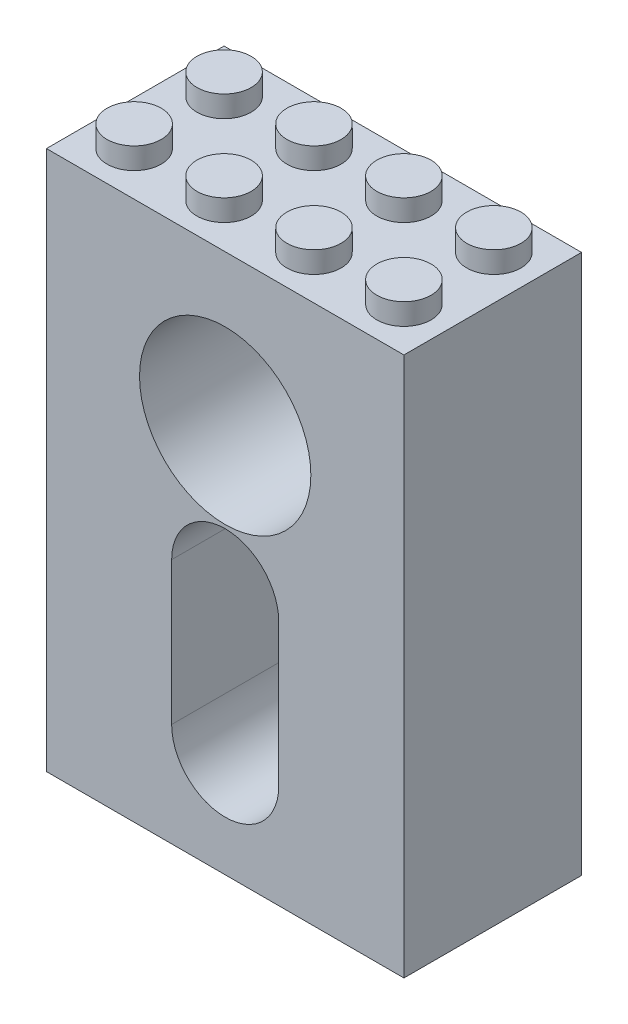
ISO-10303-21;
HEADER;
FILE_DESCRIPTION(('STEP AP214'),'2;1');
FILE_NAME('part.step','',(''),(''),'','','');
FILE_SCHEMA(('AUTOMOTIVE_DESIGN { 1 0 10303 214 1 1 1 1 }'));
ENDSEC;
DATA;
#1=APPLICATION_CONTEXT('core data for automotive mechanical design processes');
#2=APPLICATION_PROTOCOL_DEFINITION('international standard','automotive_design',2000,#1);
#3=PRODUCT_CONTEXT('',#1,'mechanical');
#4=PRODUCT('Part','Part','',(#3));
#5=PRODUCT_RELATED_PRODUCT_CATEGORY('part','',(#4));
#6=PRODUCT_DEFINITION_FORMATION('','',#4);
#7=PRODUCT_DEFINITION_CONTEXT('part definition',#1,'design');
#8=PRODUCT_DEFINITION('design','',#6,#7);
#9=PRODUCT_DEFINITION_SHAPE('','',#8);
#10=(LENGTH_UNIT() NAMED_UNIT(*) SI_UNIT(.MILLI.,.METRE.));
#11=(NAMED_UNIT(*) PLANE_ANGLE_UNIT() SI_UNIT($,.RADIAN.));
#12=(NAMED_UNIT(*) SI_UNIT($,.STERADIAN.) SOLID_ANGLE_UNIT());
#13=UNCERTAINTY_MEASURE_WITH_UNIT(LENGTH_MEASURE(1.E-05),#10,'distance_accuracy_value','');
#14=(GEOMETRIC_REPRESENTATION_CONTEXT(3) GLOBAL_UNCERTAINTY_ASSIGNED_CONTEXT((#13)) GLOBAL_UNIT_ASSIGNED_CONTEXT((#10,
#11,#12)) REPRESENTATION_CONTEXT('',''));
#15=CARTESIAN_POINT('',(0.,0.,0.));
#16=DIRECTION('',(0.,0.,1.));
#17=DIRECTION('',(1.,0.,0.));
#18=AXIS2_PLACEMENT_3D('',#15,#16,#17);
#19=CARTESIAN_POINT('',(-15.9,24.,15.8));
#20=DIRECTION('',(0.,-1.,0.));
#21=DIRECTION('',(0.,0.,-1.));
#22=AXIS2_PLACEMENT_3D('',#19,#20,#21);
#23=PLANE('',#22);
#24=CARTESIAN_POINT('',(12.,24.,3.9));
#25=DIRECTION('',(0.,-1.,0.));
#26=DIRECTION('',(0.,0.,-1.));
#27=AXIS2_PLACEMENT_3D('',#24,#25,#26);
#28=CIRCLE('',#27,2.41);
#29=CARTESIAN_POINT('',(12.,24.,1.49));
#30=VERTEX_POINT('',#29);
#31=EDGE_CURVE('E40',#30,#30,#28,.F.);
#32=ORIENTED_EDGE('',*,*,#31,.F.);
#33=EDGE_LOOP('',(#32));
#34=FACE_BOUND('',#33,.T.);
#35=CARTESIAN_POINT('',(4.,24.,3.9));
#36=DIRECTION('',(0.,-1.,0.));
#37=DIRECTION('',(0.,0.,-1.));
#38=AXIS2_PLACEMENT_3D('',#35,#36,#37);
#39=CIRCLE('',#38,2.41);
#40=CARTESIAN_POINT('',(4.,24.,1.49));
#41=VERTEX_POINT('',#40);
#42=EDGE_CURVE('E339',#41,#41,#39,.F.);
#43=ORIENTED_EDGE('',*,*,#42,.F.);
#44=EDGE_LOOP('',(#43));
#45=FACE_BOUND('',#44,.T.);
#46=CARTESIAN_POINT('',(-4.,24.,3.9));
#47=DIRECTION('',(0.,-1.,0.));
#48=DIRECTION('',(0.,0.,-1.));
#49=AXIS2_PLACEMENT_3D('',#46,#47,#48);
#50=CIRCLE('',#49,2.41);
#51=CARTESIAN_POINT('',(-4.,24.,1.49));
#52=VERTEX_POINT('',#51);
#53=EDGE_CURVE('E333',#52,#52,#50,.F.);
#54=ORIENTED_EDGE('',*,*,#53,.F.);
#55=EDGE_LOOP('',(#54));
#56=FACE_BOUND('',#55,.T.);
#57=CARTESIAN_POINT('',(-12.,24.,3.9));
#58=DIRECTION('',(0.,-1.,0.));
#59=DIRECTION('',(0.,0.,-1.));
#60=AXIS2_PLACEMENT_3D('',#57,#58,#59);
#61=CIRCLE('',#60,2.41);
#62=CARTESIAN_POINT('',(-12.,24.,1.49));
#63=VERTEX_POINT('',#62);
#64=EDGE_CURVE('E319',#63,#63,#61,.F.);
#65=ORIENTED_EDGE('',*,*,#64,.F.);
#66=EDGE_LOOP('',(#65));
#67=FACE_BOUND('',#66,.T.);
#68=DIRECTION('',(-1.,0.,0.));
#69=VECTOR('',#68,1.);
#70=CARTESIAN_POINT('',(-15.9,24.,0.));
#71=LINE('',#70,#69);
#72=CARTESIAN_POINT('',(15.9,24.,0.));
#73=VERTEX_POINT('',#72);
#74=CARTESIAN_POINT('',(-15.9,24.,0.));
#75=VERTEX_POINT('',#74);
#76=EDGE_CURVE('E303',#73,#75,#71,.T.);
#77=ORIENTED_EDGE('',*,*,#76,.T.);
#78=DIRECTION('',(0.,0.,-1.));
#79=VECTOR('',#78,1.);
#80=CARTESIAN_POINT('',(-15.9,24.,15.8));
#81=LINE('',#80,#79);
#82=CARTESIAN_POINT('',(-15.9,24.,15.8));
#83=VERTEX_POINT('',#82);
#84=EDGE_CURVE('E313',#83,#75,#81,.T.);
#85=ORIENTED_EDGE('',*,*,#84,.F.);
#86=DIRECTION('',(-1.,0.,0.));
#87=VECTOR('',#86,1.);
#88=CARTESIAN_POINT('',(-15.9,24.,15.8));
#89=LINE('',#88,#87);
#90=CARTESIAN_POINT('',(15.9,24.,15.8));
#91=VERTEX_POINT('',#90);
#92=EDGE_CURVE('E293',#91,#83,#89,.T.);
#93=ORIENTED_EDGE('',*,*,#92,.F.);
#94=DIRECTION('',(0.,0.,-1.));
#95=VECTOR('',#94,1.);
#96=CARTESIAN_POINT('',(15.9,24.,15.8));
#97=LINE('',#96,#95);
#98=EDGE_CURVE('E316',#91,#73,#97,.T.);
#99=ORIENTED_EDGE('',*,*,#98,.T.);
#100=EDGE_LOOP('',(#77,#85,#93,#99));
#101=FACE_BOUND('',#100,.T.);
#102=CARTESIAN_POINT('',(-12.,24.,11.9));
#103=DIRECTION('',(0.,-1.,0.));
#104=DIRECTION('',(0.,0.,-1.));
#105=AXIS2_PLACEMENT_3D('',#102,#103,#104);
#106=CIRCLE('',#105,2.41);
#107=CARTESIAN_POINT('',(-12.,24.,9.49));
#108=VERTEX_POINT('',#107);
#109=EDGE_CURVE('E330',#108,#108,#106,.F.);
#110=ORIENTED_EDGE('',*,*,#109,.F.);
#111=EDGE_LOOP('',(#110));
#112=FACE_BOUND('',#111,.T.);
#113=CARTESIAN_POINT('',(-4.,24.,11.9));
#114=DIRECTION('',(0.,-1.,0.));
#115=DIRECTION('',(0.,0.,-1.));
#116=AXIS2_PLACEMENT_3D('',#113,#114,#115);
#117=CIRCLE('',#116,2.41);
#118=CARTESIAN_POINT('',(-4.,24.,9.49));
#119=VERTEX_POINT('',#118);
#120=EDGE_CURVE('E336',#119,#119,#117,.F.);
#121=ORIENTED_EDGE('',*,*,#120,.F.);
#122=EDGE_LOOP('',(#121));
#123=FACE_BOUND('',#122,.T.);
#124=CARTESIAN_POINT('',(4.,24.,11.9));
#125=DIRECTION('',(0.,-1.,0.));
#126=DIRECTION('',(0.,0.,-1.));
#127=AXIS2_PLACEMENT_3D('',#124,#125,#126);
#128=CIRCLE('',#127,2.41);
#129=CARTESIAN_POINT('',(4.,24.,9.49));
#130=VERTEX_POINT('',#129);
#131=EDGE_CURVE('E342',#130,#130,#128,.F.);
#132=ORIENTED_EDGE('',*,*,#131,.F.);
#133=EDGE_LOOP('',(#132));
#134=FACE_BOUND('',#133,.T.);
#135=CARTESIAN_POINT('',(12.,24.,11.9));
#136=DIRECTION('',(0.,-1.,0.));
#137=DIRECTION('',(0.,0.,-1.));
#138=AXIS2_PLACEMENT_3D('',#135,#136,#137);
#139=CIRCLE('',#138,2.41);
#140=CARTESIAN_POINT('',(12.,24.,9.49));
#141=VERTEX_POINT('',#140);
#142=EDGE_CURVE('E11',#141,#141,#139,.F.);
#143=ORIENTED_EDGE('',*,*,#142,.F.);
#144=EDGE_LOOP('',(#143));
#145=FACE_BOUND('',#144,.T.);
#146=ADVANCED_FACE('F32',(#34,#45,#56,#67,#101,#112,#123,#134,#145),#23,.F.);
#147=CARTESIAN_POINT('',(0.,-2.1,12.7));
#148=DIRECTION('',(0.,0.,-1.));
#149=DIRECTION('',(-1.,0.,0.));
#150=AXIS2_PLACEMENT_3D('',#147,#148,#149);
#151=CYLINDRICAL_SURFACE('',#150,1.8415);
#152=CARTESIAN_POINT('',(0.,-2.1,3.1));
#153=DIRECTION('',(0.,0.,1.));
#154=DIRECTION('',(1.,0.,0.));
#155=AXIS2_PLACEMENT_3D('',#152,#153,#154);
#156=CIRCLE('',#155,1.8415);
#157=CARTESIAN_POINT('',(1.8415,-2.1,3.1));
#158=VERTEX_POINT('',#157);
#159=EDGE_CURVE('E250',#158,#158,#156,.T.);
#160=ORIENTED_EDGE('',*,*,#159,.T.);
#161=EDGE_LOOP('',(#160));
#162=FACE_BOUND('',#161,.T.);
#163=CARTESIAN_POINT('',(0.,-2.1,1.905));
#164=DIRECTION('',(0.,0.,-1.));
#165=DIRECTION('',(-1.,0.,0.));
#166=AXIS2_PLACEMENT_3D('',#163,#164,#165);
#167=CIRCLE('',#166,1.8415);
#168=CARTESIAN_POINT('',(-1.8415,-2.1,1.905));
#169=VERTEX_POINT('',#168);
#170=EDGE_CURVE('E242',#169,#169,#167,.F.);
#171=ORIENTED_EDGE('',*,*,#170,.F.);
#172=EDGE_LOOP('',(#171));
#173=FACE_BOUND('',#172,.T.);
#174=ADVANCED_FACE('F351',(#162,#173),#151,.F.);
#175=CARTESIAN_POINT('',(0.,-14.8,12.7));
#176=DIRECTION('',(0.,0.,-1.));
#177=DIRECTION('',(-1.,0.,0.));
#178=AXIS2_PLACEMENT_3D('',#175,#176,#177);
#179=CYLINDRICAL_SURFACE('',#178,1.8415);
#180=CARTESIAN_POINT('',(0.,-14.8,3.1));
#181=DIRECTION('',(0.,0.,1.));
#182=DIRECTION('',(1.,0.,0.));
#183=AXIS2_PLACEMENT_3D('',#180,#181,#182);
#184=CIRCLE('',#183,1.8415);
#185=CARTESIAN_POINT('',(1.8415,-14.8,3.1));
#186=VERTEX_POINT('',#185);
#187=EDGE_CURVE('E245',#186,#186,#184,.T.);
#188=ORIENTED_EDGE('',*,*,#187,.T.);
#189=EDGE_LOOP('',(#188));
#190=FACE_BOUND('',#189,.T.);
#191=CARTESIAN_POINT('',(0.,-14.8,1.905));
#192=DIRECTION('',(0.,0.,-1.));
#193=DIRECTION('',(-1.,0.,0.));
#194=AXIS2_PLACEMENT_3D('',#191,#192,#193);
#195=CIRCLE('',#194,1.8415);
#196=CARTESIAN_POINT('',(-1.8415,-14.8,1.905));
#197=VERTEX_POINT('',#196);
#198=EDGE_CURVE('E236',#197,#197,#195,.F.);
#199=ORIENTED_EDGE('',*,*,#198,.F.);
#200=EDGE_LOOP('',(#199));
#201=FACE_BOUND('',#200,.T.);
#202=ADVANCED_FACE('F456',(#190,#201),#179,.F.);
#203=CARTESIAN_POINT('',(15.9,24.,15.8));
#204=DIRECTION('',(-1.,0.,0.));
#205=DIRECTION('',(0.,-1.,0.));
#206=AXIS2_PLACEMENT_3D('',#203,#204,#205);
#207=PLANE('',#206);
#208=DIRECTION('',(0.,1.,0.));
#209=VECTOR('',#208,1.);
#210=CARTESIAN_POINT('',(15.9,24.,0.));
#211=LINE('',#210,#209);
#212=CARTESIAN_POINT('',(15.9,-24.,0.));
#213=VERTEX_POINT('',#212);
#214=EDGE_CURVE('E287',#213,#73,#211,.T.);
#215=ORIENTED_EDGE('',*,*,#214,.T.);
#216=ORIENTED_EDGE('',*,*,#98,.F.);
#217=DIRECTION('',(0.,1.,0.));
#218=VECTOR('',#217,1.);
#219=CARTESIAN_POINT('',(15.9,24.,15.8));
#220=LINE('',#219,#218);
#221=CARTESIAN_POINT('',(15.9,-24.,15.8));
#222=VERTEX_POINT('',#221);
#223=EDGE_CURVE('E290',#222,#91,#220,.T.);
#224=ORIENTED_EDGE('',*,*,#223,.F.);
#225=DIRECTION('',(0.,0.,-1.));
#226=VECTOR('',#225,1.);
#227=CARTESIAN_POINT('',(15.9,-24.,15.8));
#228=LINE('',#227,#226);
#229=EDGE_CURVE('E300',#222,#213,#228,.T.);
#230=ORIENTED_EDGE('',*,*,#229,.T.);
#231=EDGE_LOOP('',(#215,#216,#224,#230));
#232=FACE_BOUND('',#231,.T.);
#233=ADVANCED_FACE('F34',(#232),#207,.F.);
#234=CARTESIAN_POINT('',(-15.9,24.,15.8));
#235=DIRECTION('',(1.,0.,0.));
#236=DIRECTION('',(0.,1.,0.));
#237=AXIS2_PLACEMENT_3D('',#234,#235,#236);
#238=PLANE('',#237);
#239=DIRECTION('',(0.,-1.,0.));
#240=VECTOR('',#239,1.);
#241=CARTESIAN_POINT('',(-15.9,24.,0.));
#242=LINE('',#241,#240);
#243=CARTESIAN_POINT('',(-15.9,-24.,0.));
#244=VERTEX_POINT('',#243);
#245=EDGE_CURVE('E305',#75,#244,#242,.T.);
#246=ORIENTED_EDGE('',*,*,#245,.T.);
#247=DIRECTION('',(0.,0.,-1.));
#248=VECTOR('',#247,1.);
#249=CARTESIAN_POINT('',(-15.9,-24.,15.8));
#250=LINE('',#249,#248);
#251=CARTESIAN_POINT('',(-15.9,-24.,15.8));
#252=VERTEX_POINT('',#251);
#253=EDGE_CURVE('E310',#252,#244,#250,.T.);
#254=ORIENTED_EDGE('',*,*,#253,.F.);
#255=DIRECTION('',(0.,-1.,0.));
#256=VECTOR('',#255,1.);
#257=CARTESIAN_POINT('',(-15.9,24.,15.8));
#258=LINE('',#257,#256);
#259=EDGE_CURVE('E296',#83,#252,#258,.T.);
#260=ORIENTED_EDGE('',*,*,#259,.F.);
#261=ORIENTED_EDGE('',*,*,#84,.T.);
#262=EDGE_LOOP('',(#246,#254,#260,#261));
#263=FACE_BOUND('',#262,.T.);
#264=ADVANCED_FACE('F505',(#263),#238,.F.);
#265=CARTESIAN_POINT('',(-15.9,-24.,15.8));
#266=DIRECTION('',(0.,1.,0.));
#267=DIRECTION('',(0.,0.,1.));
#268=AXIS2_PLACEMENT_3D('',#265,#266,#267);
#269=PLANE('',#268);
#270=DIRECTION('',(1.,0.,0.));
#271=VECTOR('',#270,1.);
#272=CARTESIAN_POINT('',(-14.68,-24.,1.22));
#273=LINE('',#272,#271);
#274=CARTESIAN_POINT('',(-14.68,-24.,1.22));
#275=VERTEX_POINT('',#274);
#276=CARTESIAN_POINT('',(14.68,-24.,1.22));
#277=VERTEX_POINT('',#276);
#278=EDGE_CURVE('E177',#275,#277,#273,.T.);
#279=ORIENTED_EDGE('',*,*,#278,.F.);
#280=DIRECTION('',(0.,0.,-1.));
#281=VECTOR('',#280,1.);
#282=CARTESIAN_POINT('',(-14.68,-24.,14.58));
#283=LINE('',#282,#281);
#284=CARTESIAN_POINT('',(-14.68,-24.,14.58));
#285=VERTEX_POINT('',#284);
#286=EDGE_CURVE('E47',#285,#275,#283,.T.);
#287=ORIENTED_EDGE('',*,*,#286,.F.);
#288=DIRECTION('',(-1.,0.,0.));
#289=VECTOR('',#288,1.);
#290=CARTESIAN_POINT('',(-14.68,-24.,14.58));
#291=LINE('',#290,#289);
#292=CARTESIAN_POINT('',(14.68,-24.,14.58));
#293=VERTEX_POINT('',#292);
#294=EDGE_CURVE('E165',#293,#285,#291,.T.);
#295=ORIENTED_EDGE('',*,*,#294,.F.);
#296=DIRECTION('',(0.,0.,1.));
#297=VECTOR('',#296,1.);
#298=CARTESIAN_POINT('',(14.68,-24.,14.58));
#299=LINE('',#298,#297);
#300=EDGE_CURVE('E168',#277,#293,#299,.T.);
#301=ORIENTED_EDGE('',*,*,#300,.F.);
#302=EDGE_LOOP('',(#279,#287,#295,#301));
#303=FACE_BOUND('',#302,.T.);
#304=DIRECTION('',(1.,0.,0.));
#305=VECTOR('',#304,1.);
#306=CARTESIAN_POINT('',(-15.9,-24.,0.));
#307=LINE('',#306,#305);
#308=EDGE_CURVE('E294',#244,#213,#307,.T.);
#309=ORIENTED_EDGE('',*,*,#308,.T.);
#310=ORIENTED_EDGE('',*,*,#229,.F.);
#311=DIRECTION('',(1.,0.,0.));
#312=VECTOR('',#311,1.);
#313=CARTESIAN_POINT('',(-15.9,-24.,15.8));
#314=LINE('',#313,#312);
#315=EDGE_CURVE('E298',#252,#222,#314,.T.);
#316=ORIENTED_EDGE('',*,*,#315,.F.);
#317=ORIENTED_EDGE('',*,*,#253,.T.);
#318=EDGE_LOOP('',(#309,#310,#316,#317));
#319=FACE_BOUND('',#318,.T.);
#320=ADVANCED_FACE('F498',(#303,#319),#269,.F.);
#321=CARTESIAN_POINT('',(15.9,-24.,15.8));
#322=DIRECTION('',(0.,0.,1.));
#323=DIRECTION('',(1.,0.,0.));
#324=AXIS2_PLACEMENT_3D('',#321,#322,#323);
#325=PLANE('',#324);
#326=CARTESIAN_POINT('',(0.,-2.1,15.8));
#327=DIRECTION('',(0.,0.,1.));
#328=DIRECTION('',(1.,0.,0.));
#329=AXIS2_PLACEMENT_3D('',#326,#327,#328);
#330=CIRCLE('',#329,4.7625);
#331=CARTESIAN_POINT('',(4.7625,-2.1,15.8));
#332=VERTEX_POINT('',#331);
#333=CARTESIAN_POINT('',(-4.7625,-2.1,15.8));
#334=VERTEX_POINT('',#333);
#335=EDGE_CURVE('E265',#332,#334,#330,.T.);
#336=ORIENTED_EDGE('',*,*,#335,.F.);
#337=DIRECTION('',(0.,1.,0.));
#338=VECTOR('',#337,1.);
#339=CARTESIAN_POINT('',(4.7625,-2.1,15.8));
#340=LINE('',#339,#338);
#341=CARTESIAN_POINT('',(4.7625,-14.8,15.8));
#342=VERTEX_POINT('',#341);
#343=EDGE_CURVE('E255',#342,#332,#340,.T.);
#344=ORIENTED_EDGE('',*,*,#343,.F.);
#345=CARTESIAN_POINT('',(0.,-14.8,15.8));
#346=DIRECTION('',(0.,0.,1.));
#347=DIRECTION('',(1.,0.,0.));
#348=AXIS2_PLACEMENT_3D('',#345,#346,#347);
#349=CIRCLE('',#348,4.7625);
#350=CARTESIAN_POINT('',(-4.7625,-14.8,15.8));
#351=VERTEX_POINT('',#350);
#352=EDGE_CURVE('E270',#351,#342,#349,.T.);
#353=ORIENTED_EDGE('',*,*,#352,.F.);
#354=DIRECTION('',(0.,-1.,0.));
#355=VECTOR('',#354,1.);
#356=CARTESIAN_POINT('',(-4.7625,-2.1,15.8));
#357=LINE('',#356,#355);
#358=EDGE_CURVE('E267',#334,#351,#357,.T.);
#359=ORIENTED_EDGE('',*,*,#358,.F.);
#360=EDGE_LOOP('',(#336,#344,#353,#359));
#361=FACE_BOUND('',#360,.T.);
#362=CARTESIAN_POINT('',(0.,10.6,15.8));
#363=DIRECTION('',(0.,0.,1.));
#364=DIRECTION('',(1.,0.,0.));
#365=AXIS2_PLACEMENT_3D('',#362,#363,#364);
#366=CIRCLE('',#365,7.62);
#367=CARTESIAN_POINT('',(7.62,10.6,15.8));
#368=VERTEX_POINT('',#367);
#369=EDGE_CURVE('E277',#368,#368,#366,.T.);
#370=ORIENTED_EDGE('',*,*,#369,.F.);
#371=EDGE_LOOP('',(#370));
#372=FACE_BOUND('',#371,.T.);
#373=ORIENTED_EDGE('',*,*,#223,.T.);
#374=ORIENTED_EDGE('',*,*,#92,.T.);
#375=ORIENTED_EDGE('',*,*,#259,.T.);
#376=ORIENTED_EDGE('',*,*,#315,.T.);
#377=EDGE_LOOP('',(#373,#374,#375,#376));
#378=FACE_BOUND('',#377,.T.);
#379=ADVANCED_FACE('F495',(#361,#372,#378),#325,.T.);
#380=CARTESIAN_POINT('',(15.9,-24.,0.));
#381=DIRECTION('',(0.,0.,1.));
#382=DIRECTION('',(1.,0.,0.));
#383=AXIS2_PLACEMENT_3D('',#380,#381,#382);
#384=PLANE('',#383);
#385=DIRECTION('',(0.,-1.,0.));
#386=VECTOR('',#385,1.);
#387=CARTESIAN_POINT('',(4.7625,-2.1,0.));
#388=LINE('',#387,#386);
#389=CARTESIAN_POINT('',(4.7625,-2.1,0.));
#390=VERTEX_POINT('',#389);
#391=CARTESIAN_POINT('',(4.7625,-14.8,0.));
#392=VERTEX_POINT('',#391);
#393=EDGE_CURVE('E226',#390,#392,#388,.T.);
#394=ORIENTED_EDGE('',*,*,#393,.F.);
#395=CARTESIAN_POINT('',(0.,-2.1,0.));
#396=DIRECTION('',(0.,0.,-1.));
#397=DIRECTION('',(-1.,0.,0.));
#398=AXIS2_PLACEMENT_3D('',#395,#396,#397);
#399=CIRCLE('',#398,4.7625);
#400=CARTESIAN_POINT('',(-4.7625,-2.1,0.));
#401=VERTEX_POINT('',#400);
#402=EDGE_CURVE('E55',#401,#390,#399,.T.);
#403=ORIENTED_EDGE('',*,*,#402,.F.);
#404=DIRECTION('',(0.,1.,0.));
#405=VECTOR('',#404,1.);
#406=CARTESIAN_POINT('',(-4.7625,-14.8,0.));
#407=LINE('',#406,#405);
#408=CARTESIAN_POINT('',(-4.7625,-14.8,0.));
#409=VERTEX_POINT('',#408);
#410=EDGE_CURVE('E215',#409,#401,#407,.T.);
#411=ORIENTED_EDGE('',*,*,#410,.F.);
#412=CARTESIAN_POINT('',(0.,-14.8,0.));
#413=DIRECTION('',(0.,0.,-1.));
#414=DIRECTION('',(-1.,0.,0.));
#415=AXIS2_PLACEMENT_3D('',#412,#413,#414);
#416=CIRCLE('',#415,4.7625);
#417=EDGE_CURVE('E229',#392,#409,#416,.T.);
#418=ORIENTED_EDGE('',*,*,#417,.F.);
#419=EDGE_LOOP('',(#394,#403,#411,#418));
#420=FACE_BOUND('',#419,.T.);
#421=CARTESIAN_POINT('',(0.,10.6,0.));
#422=DIRECTION('',(0.,0.,-1.));
#423=DIRECTION('',(-1.,0.,0.));
#424=AXIS2_PLACEMENT_3D('',#421,#422,#423);
#425=CIRCLE('',#424,2.77815);
#426=CARTESIAN_POINT('',(-2.77815,10.6,0.));
#427=VERTEX_POINT('',#426);
#428=EDGE_CURVE('E246',#427,#427,#425,.T.);
#429=ORIENTED_EDGE('',*,*,#428,.F.);
#430=EDGE_LOOP('',(#429));
#431=FACE_BOUND('',#430,.T.);
#432=ORIENTED_EDGE('',*,*,#214,.F.);
#433=ORIENTED_EDGE('',*,*,#308,.F.);
#434=ORIENTED_EDGE('',*,*,#245,.F.);
#435=ORIENTED_EDGE('',*,*,#76,.F.);
#436=EDGE_LOOP('',(#432,#433,#434,#435));
#437=FACE_BOUND('',#436,.T.);
#438=ADVANCED_FACE('F493',(#420,#431,#437),#384,.F.);
#439=CARTESIAN_POINT('',(0.,10.6,3.1));
#440=DIRECTION('',(0.,0.,1.));
#441=DIRECTION('',(1.,0.,0.));
#442=AXIS2_PLACEMENT_3D('',#439,#440,#441);
#443=CYLINDRICAL_SURFACE('',#442,7.62);
#444=CARTESIAN_POINT('',(0.,10.6,3.1));
#445=DIRECTION('',(0.,0.,1.));
#446=DIRECTION('',(1.,0.,0.));
#447=AXIS2_PLACEMENT_3D('',#444,#445,#446);
#448=CIRCLE('',#447,7.62);
#449=CARTESIAN_POINT('',(7.62,10.6,3.1));
#450=VERTEX_POINT('',#449);
#451=EDGE_CURVE('E284',#450,#450,#448,.T.);
#452=ORIENTED_EDGE('',*,*,#451,.F.);
#453=EDGE_LOOP('',(#452));
#454=FACE_BOUND('',#453,.T.);
#455=ORIENTED_EDGE('',*,*,#369,.T.);
#456=EDGE_LOOP('',(#455));
#457=FACE_BOUND('',#456,.T.);
#458=ADVANCED_FACE('F489',(#454,#457),#443,.F.);
#459=CARTESIAN_POINT('',(0.,10.6,3.1));
#460=DIRECTION('',(0.,0.,1.));
#461=DIRECTION('',(1.,0.,0.));
#462=AXIS2_PLACEMENT_3D('',#459,#460,#461);
#463=PLANE('',#462);
#464=CARTESIAN_POINT('',(0.,10.6,3.1));
#465=DIRECTION('',(0.,0.,1.));
#466=DIRECTION('',(1.,0.,0.));
#467=AXIS2_PLACEMENT_3D('',#464,#465,#466);
#468=CIRCLE('',#467,2.77815);
#469=CARTESIAN_POINT('',(2.77815,10.6,3.1));
#470=VERTEX_POINT('',#469);
#471=EDGE_CURVE('E249',#470,#470,#468,.T.);
#472=ORIENTED_EDGE('',*,*,#471,.F.);
#473=EDGE_LOOP('',(#472));
#474=FACE_BOUND('',#473,.T.);
#475=ORIENTED_EDGE('',*,*,#451,.T.);
#476=EDGE_LOOP('',(#475));
#477=FACE_BOUND('',#476,.T.);
#478=ADVANCED_FACE('F485',(#474,#477),#463,.T.);
#479=CARTESIAN_POINT('',(0.,-2.1,3.1));
#480=DIRECTION('',(0.,0.,1.));
#481=DIRECTION('',(1.,0.,0.));
#482=AXIS2_PLACEMENT_3D('',#479,#480,#481);
#483=CYLINDRICAL_SURFACE('',#482,4.7625);
#484=ORIENTED_EDGE('',*,*,#335,.T.);
#485=DIRECTION('',(0.,0.,1.));
#486=VECTOR('',#485,1.);
#487=CARTESIAN_POINT('',(-4.7625,-2.1,3.1));
#488=LINE('',#487,#486);
#489=CARTESIAN_POINT('',(-4.7625,-2.1,3.1));
#490=VERTEX_POINT('',#489);
#491=EDGE_CURVE('E264',#490,#334,#488,.T.);
#492=ORIENTED_EDGE('',*,*,#491,.F.);
#493=CARTESIAN_POINT('',(0.,-2.1,3.1));
#494=DIRECTION('',(0.,0.,1.));
#495=DIRECTION('',(1.,0.,0.));
#496=AXIS2_PLACEMENT_3D('',#493,#494,#495);
#497=CIRCLE('',#496,4.7625);
#498=CARTESIAN_POINT('',(4.7625,-2.1,3.1));
#499=VERTEX_POINT('',#498);
#500=EDGE_CURVE('E251',#499,#490,#497,.T.);
#501=ORIENTED_EDGE('',*,*,#500,.F.);
#502=DIRECTION('',(0.,0.,1.));
#503=VECTOR('',#502,1.);
#504=CARTESIAN_POINT('',(4.7625,-2.1,3.1));
#505=LINE('',#504,#503);
#506=EDGE_CURVE('E275',#499,#332,#505,.T.);
#507=ORIENTED_EDGE('',*,*,#506,.T.);
#508=EDGE_LOOP('',(#484,#492,#501,#507));
#509=FACE_BOUND('',#508,.T.);
#510=ADVANCED_FACE('F475',(#509),#483,.F.);
#511=CARTESIAN_POINT('',(4.7625,-2.1,3.1));
#512=DIRECTION('',(1.,0.,0.));
#513=DIRECTION('',(0.,1.,0.));
#514=AXIS2_PLACEMENT_3D('',#511,#512,#513);
#515=PLANE('',#514);
#516=ORIENTED_EDGE('',*,*,#343,.T.);
#517=ORIENTED_EDGE('',*,*,#506,.F.);
#518=DIRECTION('',(0.,1.,0.));
#519=VECTOR('',#518,1.);
#520=CARTESIAN_POINT('',(4.7625,-2.1,3.1));
#521=LINE('',#520,#519);
#522=CARTESIAN_POINT('',(4.7625,-14.8,3.1));
#523=VERTEX_POINT('',#522);
#524=EDGE_CURVE('E261',#523,#499,#521,.T.);
#525=ORIENTED_EDGE('',*,*,#524,.F.);
#526=DIRECTION('',(0.,0.,1.));
#527=VECTOR('',#526,1.);
#528=CARTESIAN_POINT('',(4.7625,-14.8,3.1));
#529=LINE('',#528,#527);
#530=EDGE_CURVE('E278',#523,#342,#529,.T.);
#531=ORIENTED_EDGE('',*,*,#530,.T.);
#532=EDGE_LOOP('',(#516,#517,#525,#531));
#533=FACE_BOUND('',#532,.T.);
#534=ADVANCED_FACE('F471',(#533),#515,.F.);
#535=CARTESIAN_POINT('',(0.,-14.8,3.1));
#536=DIRECTION('',(0.,0.,1.));
#537=DIRECTION('',(1.,0.,0.));
#538=AXIS2_PLACEMENT_3D('',#535,#536,#537);
#539=CYLINDRICAL_SURFACE('',#538,4.7625);
#540=ORIENTED_EDGE('',*,*,#352,.T.);
#541=ORIENTED_EDGE('',*,*,#530,.F.);
#542=CARTESIAN_POINT('',(0.,-14.8,3.1));
#543=DIRECTION('',(0.,0.,1.));
#544=DIRECTION('',(1.,0.,0.));
#545=AXIS2_PLACEMENT_3D('',#542,#543,#544);
#546=CIRCLE('',#545,4.7625);
#547=CARTESIAN_POINT('',(-4.7625,-14.8,3.1));
#548=VERTEX_POINT('',#547);
#549=EDGE_CURVE('E258',#548,#523,#546,.T.);
#550=ORIENTED_EDGE('',*,*,#549,.F.);
#551=DIRECTION('',(0.,0.,1.));
#552=VECTOR('',#551,1.);
#553=CARTESIAN_POINT('',(-4.7625,-14.8,3.1));
#554=LINE('',#553,#552);
#555=EDGE_CURVE('E280',#548,#351,#554,.T.);
#556=ORIENTED_EDGE('',*,*,#555,.T.);
#557=EDGE_LOOP('',(#540,#541,#550,#556));
#558=FACE_BOUND('',#557,.T.);
#559=ADVANCED_FACE('F474',(#558),#539,.F.);
#560=CARTESIAN_POINT('',(-4.7625,-2.1,3.1));
#561=DIRECTION('',(-1.,0.,0.));
#562=DIRECTION('',(0.,-1.,0.));
#563=AXIS2_PLACEMENT_3D('',#560,#561,#562);
#564=PLANE('',#563);
#565=ORIENTED_EDGE('',*,*,#358,.T.);
#566=ORIENTED_EDGE('',*,*,#555,.F.);
#567=DIRECTION('',(0.,-1.,0.));
#568=VECTOR('',#567,1.);
#569=CARTESIAN_POINT('',(-4.7625,-2.1,3.1));
#570=LINE('',#569,#568);
#571=EDGE_CURVE('E254',#490,#548,#570,.T.);
#572=ORIENTED_EDGE('',*,*,#571,.F.);
#573=ORIENTED_EDGE('',*,*,#491,.T.);
#574=EDGE_LOOP('',(#565,#566,#572,#573));
#575=FACE_BOUND('',#574,.T.);
#576=ADVANCED_FACE('F469',(#575),#564,.F.);
#577=CARTESIAN_POINT('',(0.,-2.1,3.1));
#578=DIRECTION('',(0.,0.,1.));
#579=DIRECTION('',(1.,0.,0.));
#580=AXIS2_PLACEMENT_3D('',#577,#578,#579);
#581=PLANE('',#580);
#582=ORIENTED_EDGE('',*,*,#187,.F.);
#583=EDGE_LOOP('',(#582));
#584=FACE_BOUND('',#583,.T.);
#585=ORIENTED_EDGE('',*,*,#159,.F.);
#586=EDGE_LOOP('',(#585));
#587=FACE_BOUND('',#586,.T.);
#588=ORIENTED_EDGE('',*,*,#500,.T.);
#589=ORIENTED_EDGE('',*,*,#571,.T.);
#590=ORIENTED_EDGE('',*,*,#549,.T.);
#591=ORIENTED_EDGE('',*,*,#524,.T.);
#592=EDGE_LOOP('',(#588,#589,#590,#591));
#593=FACE_BOUND('',#592,.T.);
#594=ADVANCED_FACE('F465',(#584,#587,#593),#581,.T.);
#595=CARTESIAN_POINT('',(0.,10.6,12.7));
#596=DIRECTION('',(0.,0.,-1.));
#597=DIRECTION('',(-1.,0.,0.));
#598=AXIS2_PLACEMENT_3D('',#595,#596,#597);
#599=CYLINDRICAL_SURFACE('',#598,2.77815);
#600=ORIENTED_EDGE('',*,*,#471,.T.);
#601=EDGE_LOOP('',(#600));
#602=FACE_BOUND('',#601,.T.);
#603=ORIENTED_EDGE('',*,*,#428,.T.);
#604=EDGE_LOOP('',(#603));
#605=FACE_BOUND('',#604,.T.);
#606=ADVANCED_FACE('F441',(#602,#605),#599,.F.);
#607=CARTESIAN_POINT('',(0.,-2.1,1.905));
#608=DIRECTION('',(0.,0.,-1.));
#609=DIRECTION('',(-1.,0.,0.));
#610=AXIS2_PLACEMENT_3D('',#607,#608,#609);
#611=PLANE('',#610);
#612=ORIENTED_EDGE('',*,*,#198,.T.);
#613=EDGE_LOOP('',(#612));
#614=FACE_BOUND('',#613,.T.);
#615=CARTESIAN_POINT('',(0.,-2.1,1.905));
#616=DIRECTION('',(0.,0.,-1.));
#617=DIRECTION('',(-1.,0.,0.));
#618=AXIS2_PLACEMENT_3D('',#615,#616,#617);
#619=CIRCLE('',#618,4.7625);
#620=CARTESIAN_POINT('',(-4.7625,-2.1,1.905));
#621=VERTEX_POINT('',#620);
#622=CARTESIAN_POINT('',(4.7625,-2.1,1.905));
#623=VERTEX_POINT('',#622);
#624=EDGE_CURVE('E211',#621,#623,#619,.T.);
#625=ORIENTED_EDGE('',*,*,#624,.T.);
#626=DIRECTION('',(0.,-1.,0.));
#627=VECTOR('',#626,1.);
#628=CARTESIAN_POINT('',(4.7625,-2.1,1.905));
#629=LINE('',#628,#627);
#630=CARTESIAN_POINT('',(4.7625,-14.8,1.905));
#631=VERTEX_POINT('',#630);
#632=EDGE_CURVE('E214',#623,#631,#629,.T.);
#633=ORIENTED_EDGE('',*,*,#632,.T.);
#634=CARTESIAN_POINT('',(0.,-14.8,1.905));
#635=DIRECTION('',(0.,0.,-1.));
#636=DIRECTION('',(-1.,0.,0.));
#637=AXIS2_PLACEMENT_3D('',#634,#635,#636);
#638=CIRCLE('',#637,4.7625);
#639=CARTESIAN_POINT('',(-4.7625,-14.8,1.905));
#640=VERTEX_POINT('',#639);
#641=EDGE_CURVE('E218',#631,#640,#638,.T.);
#642=ORIENTED_EDGE('',*,*,#641,.T.);
#643=DIRECTION('',(0.,1.,0.));
#644=VECTOR('',#643,1.);
#645=CARTESIAN_POINT('',(-4.7625,-14.8,1.905));
#646=LINE('',#645,#644);
#647=EDGE_CURVE('E221',#640,#621,#646,.T.);
#648=ORIENTED_EDGE('',*,*,#647,.T.);
#649=EDGE_LOOP('',(#625,#633,#642,#648));
#650=FACE_BOUND('',#649,.T.);
#651=ORIENTED_EDGE('',*,*,#170,.T.);
#652=EDGE_LOOP('',(#651));
#653=FACE_BOUND('',#652,.T.);
#654=ADVANCED_FACE('F437',(#614,#650,#653),#611,.T.);
#655=CARTESIAN_POINT('',(0.,-2.1,1.905));
#656=DIRECTION('',(0.,0.,-1.));
#657=DIRECTION('',(-1.,0.,0.));
#658=AXIS2_PLACEMENT_3D('',#655,#656,#657);
#659=CYLINDRICAL_SURFACE('',#658,4.7625);
#660=ORIENTED_EDGE('',*,*,#402,.T.);
#661=DIRECTION('',(0.,0.,-1.));
#662=VECTOR('',#661,1.);
#663=CARTESIAN_POINT('',(4.7625,-2.1,1.905));
#664=LINE('',#663,#662);
#665=EDGE_CURVE('E224',#623,#390,#664,.T.);
#666=ORIENTED_EDGE('',*,*,#665,.F.);
#667=ORIENTED_EDGE('',*,*,#624,.F.);
#668=DIRECTION('',(0.,0.,-1.));
#669=VECTOR('',#668,1.);
#670=CARTESIAN_POINT('',(-4.7625,-2.1,1.905));
#671=LINE('',#670,#669);
#672=EDGE_CURVE('E234',#621,#401,#671,.T.);
#673=ORIENTED_EDGE('',*,*,#672,.T.);
#674=EDGE_LOOP('',(#660,#666,#667,#673));
#675=FACE_BOUND('',#674,.T.);
#676=ADVANCED_FACE('F440',(#675),#659,.F.);
#677=CARTESIAN_POINT('',(-4.7625,-14.8,1.905));
#678=DIRECTION('',(-1.,0.,0.));
#679=DIRECTION('',(0.,-1.,0.));
#680=AXIS2_PLACEMENT_3D('',#677,#678,#679);
#681=PLANE('',#680);
#682=ORIENTED_EDGE('',*,*,#410,.T.);
#683=ORIENTED_EDGE('',*,*,#672,.F.);
#684=ORIENTED_EDGE('',*,*,#647,.F.);
#685=DIRECTION('',(0.,0.,-1.));
#686=VECTOR('',#685,1.);
#687=CARTESIAN_POINT('',(-4.7625,-14.8,1.905));
#688=LINE('',#687,#686);
#689=EDGE_CURVE('E237',#640,#409,#688,.T.);
#690=ORIENTED_EDGE('',*,*,#689,.T.);
#691=EDGE_LOOP('',(#682,#683,#684,#690));
#692=FACE_BOUND('',#691,.T.);
#693=ADVANCED_FACE('F443',(#692),#681,.F.);
#694=CARTESIAN_POINT('',(0.,-14.8,1.905));
#695=DIRECTION('',(0.,0.,-1.));
#696=DIRECTION('',(-1.,0.,0.));
#697=AXIS2_PLACEMENT_3D('',#694,#695,#696);
#698=CYLINDRICAL_SURFACE('',#697,4.7625);
#699=ORIENTED_EDGE('',*,*,#417,.T.);
#700=ORIENTED_EDGE('',*,*,#689,.F.);
#701=ORIENTED_EDGE('',*,*,#641,.F.);
#702=DIRECTION('',(0.,0.,-1.));
#703=VECTOR('',#702,1.);
#704=CARTESIAN_POINT('',(4.7625,-14.8,1.905));
#705=LINE('',#704,#703);
#706=EDGE_CURVE('E239',#631,#392,#705,.T.);
#707=ORIENTED_EDGE('',*,*,#706,.T.);
#708=EDGE_LOOP('',(#699,#700,#701,#707));
#709=FACE_BOUND('',#708,.T.);
#710=ADVANCED_FACE('F446',(#709),#698,.F.);
#711=CARTESIAN_POINT('',(4.7625,-2.1,1.905));
#712=DIRECTION('',(1.,0.,0.));
#713=DIRECTION('',(0.,1.,0.));
#714=AXIS2_PLACEMENT_3D('',#711,#712,#713);
#715=PLANE('',#714);
#716=ORIENTED_EDGE('',*,*,#393,.T.);
#717=ORIENTED_EDGE('',*,*,#706,.F.);
#718=ORIENTED_EDGE('',*,*,#632,.F.);
#719=ORIENTED_EDGE('',*,*,#665,.T.);
#720=EDGE_LOOP('',(#716,#717,#718,#719));
#721=FACE_BOUND('',#720,.T.);
#722=ADVANCED_FACE('F435',(#721),#715,.F.);
#723=CARTESIAN_POINT('',(-12.,25.905,3.9));
#724=DIRECTION('',(0.,-1.,0.));
#725=DIRECTION('',(0.,0.,-1.));
#726=AXIS2_PLACEMENT_3D('',#723,#724,#725);
#727=CYLINDRICAL_SURFACE('',#726,2.41);
#728=CARTESIAN_POINT('',(-12.,25.905,3.9));
#729=DIRECTION('',(0.,1.,0.));
#730=DIRECTION('',(0.,0.,1.));
#731=AXIS2_PLACEMENT_3D('',#728,#729,#730);
#732=CIRCLE('',#731,2.41);
#733=CARTESIAN_POINT('',(-12.,25.905,6.31));
#734=VERTEX_POINT('',#733);
#735=EDGE_CURVE('E208',#734,#734,#732,.T.);
#736=ORIENTED_EDGE('',*,*,#735,.F.);
#737=EDGE_LOOP('',(#736));
#738=FACE_BOUND('',#737,.T.);
#739=ORIENTED_EDGE('',*,*,#64,.T.);
#740=EDGE_LOOP('',(#739));
#741=FACE_BOUND('',#740,.T.);
#742=ADVANCED_FACE('F431',(#738,#741),#727,.T.);
#743=CARTESIAN_POINT('',(-12.,25.905,3.9));
#744=DIRECTION('',(0.,1.,0.));
#745=DIRECTION('',(0.,0.,1.));
#746=AXIS2_PLACEMENT_3D('',#743,#744,#745);
#747=PLANE('',#746);
#748=ORIENTED_EDGE('',*,*,#735,.T.);
#749=EDGE_LOOP('',(#748));
#750=FACE_BOUND('',#749,.T.);
#751=ADVANCED_FACE('F427',(#750),#747,.T.);
#752=CARTESIAN_POINT('',(-12.,25.905,11.9));
#753=DIRECTION('',(0.,-1.,0.));
#754=DIRECTION('',(0.,0.,-1.));
#755=AXIS2_PLACEMENT_3D('',#752,#753,#754);
#756=CYLINDRICAL_SURFACE('',#755,2.41);
#757=CARTESIAN_POINT('',(-12.,25.905,11.9));
#758=DIRECTION('',(0.,1.,0.));
#759=DIRECTION('',(0.,0.,1.));
#760=AXIS2_PLACEMENT_3D('',#757,#758,#759);
#761=CIRCLE('',#760,2.41);
#762=CARTESIAN_POINT('',(-12.,25.905,14.31));
#763=VERTEX_POINT('',#762);
#764=EDGE_CURVE('E205',#763,#763,#761,.T.);
#765=ORIENTED_EDGE('',*,*,#764,.F.);
#766=EDGE_LOOP('',(#765));
#767=FACE_BOUND('',#766,.T.);
#768=ORIENTED_EDGE('',*,*,#109,.T.);
#769=EDGE_LOOP('',(#768));
#770=FACE_BOUND('',#769,.T.);
#771=ADVANCED_FACE('F423',(#767,#770),#756,.T.);
#772=CARTESIAN_POINT('',(-12.,25.905,11.9));
#773=DIRECTION('',(0.,1.,0.));
#774=DIRECTION('',(0.,0.,1.));
#775=AXIS2_PLACEMENT_3D('',#772,#773,#774);
#776=PLANE('',#775);
#777=ORIENTED_EDGE('',*,*,#764,.T.);
#778=EDGE_LOOP('',(#777));
#779=FACE_BOUND('',#778,.T.);
#780=ADVANCED_FACE('F419',(#779),#776,.T.);
#781=CARTESIAN_POINT('',(-4.,25.905,3.9));
#782=DIRECTION('',(0.,-1.,0.));
#783=DIRECTION('',(0.,0.,-1.));
#784=AXIS2_PLACEMENT_3D('',#781,#782,#783);
#785=CYLINDRICAL_SURFACE('',#784,2.41);
#786=CARTESIAN_POINT('',(-4.,25.905,3.9));
#787=DIRECTION('',(0.,1.,0.));
#788=DIRECTION('',(0.,0.,1.));
#789=AXIS2_PLACEMENT_3D('',#786,#787,#788);
#790=CIRCLE('',#789,2.41);
#791=CARTESIAN_POINT('',(-4.,25.905,6.31));
#792=VERTEX_POINT('',#791);
#793=EDGE_CURVE('E202',#792,#792,#790,.T.);
#794=ORIENTED_EDGE('',*,*,#793,.F.);
#795=EDGE_LOOP('',(#794));
#796=FACE_BOUND('',#795,.T.);
#797=ORIENTED_EDGE('',*,*,#53,.T.);
#798=EDGE_LOOP('',(#797));
#799=FACE_BOUND('',#798,.T.);
#800=ADVANCED_FACE('F415',(#796,#799),#785,.T.);
#801=CARTESIAN_POINT('',(-4.,25.905,3.9));
#802=DIRECTION('',(0.,1.,0.));
#803=DIRECTION('',(0.,0.,1.));
#804=AXIS2_PLACEMENT_3D('',#801,#802,#803);
#805=PLANE('',#804);
#806=ORIENTED_EDGE('',*,*,#793,.T.);
#807=EDGE_LOOP('',(#806));
#808=FACE_BOUND('',#807,.T.);
#809=ADVANCED_FACE('F411',(#808),#805,.T.);
#810=CARTESIAN_POINT('',(-4.,25.905,11.9));
#811=DIRECTION('',(0.,-1.,0.));
#812=DIRECTION('',(0.,0.,-1.));
#813=AXIS2_PLACEMENT_3D('',#810,#811,#812);
#814=CYLINDRICAL_SURFACE('',#813,2.41);
#815=CARTESIAN_POINT('',(-4.,25.905,11.9));
#816=DIRECTION('',(0.,1.,0.));
#817=DIRECTION('',(0.,0.,1.));
#818=AXIS2_PLACEMENT_3D('',#815,#816,#817);
#819=CIRCLE('',#818,2.41);
#820=CARTESIAN_POINT('',(-4.,25.905,14.31));
#821=VERTEX_POINT('',#820);
#822=EDGE_CURVE('E199',#821,#821,#819,.T.);
#823=ORIENTED_EDGE('',*,*,#822,.F.);
#824=EDGE_LOOP('',(#823));
#825=FACE_BOUND('',#824,.T.);
#826=ORIENTED_EDGE('',*,*,#120,.T.);
#827=EDGE_LOOP('',(#826));
#828=FACE_BOUND('',#827,.T.);
#829=ADVANCED_FACE('F407',(#825,#828),#814,.T.);
#830=CARTESIAN_POINT('',(-4.,25.905,11.9));
#831=DIRECTION('',(0.,1.,0.));
#832=DIRECTION('',(0.,0.,1.));
#833=AXIS2_PLACEMENT_3D('',#830,#831,#832);
#834=PLANE('',#833);
#835=ORIENTED_EDGE('',*,*,#822,.T.);
#836=EDGE_LOOP('',(#835));
#837=FACE_BOUND('',#836,.T.);
#838=ADVANCED_FACE('F403',(#837),#834,.T.);
#839=CARTESIAN_POINT('',(4.,25.905,3.9));
#840=DIRECTION('',(0.,-1.,0.));
#841=DIRECTION('',(0.,0.,-1.));
#842=AXIS2_PLACEMENT_3D('',#839,#840,#841);
#843=CYLINDRICAL_SURFACE('',#842,2.41);
#844=CARTESIAN_POINT('',(4.,25.905,3.9));
#845=DIRECTION('',(0.,1.,0.));
#846=DIRECTION('',(0.,0.,1.));
#847=AXIS2_PLACEMENT_3D('',#844,#845,#846);
#848=CIRCLE('',#847,2.41);
#849=CARTESIAN_POINT('',(4.,25.905,6.31));
#850=VERTEX_POINT('',#849);
#851=EDGE_CURVE('E196',#850,#850,#848,.T.);
#852=ORIENTED_EDGE('',*,*,#851,.F.);
#853=EDGE_LOOP('',(#852));
#854=FACE_BOUND('',#853,.T.);
#855=ORIENTED_EDGE('',*,*,#42,.T.);
#856=EDGE_LOOP('',(#855));
#857=FACE_BOUND('',#856,.T.);
#858=ADVANCED_FACE('F399',(#854,#857),#843,.T.);
#859=CARTESIAN_POINT('',(4.,25.905,3.9));
#860=DIRECTION('',(0.,1.,0.));
#861=DIRECTION('',(0.,0.,1.));
#862=AXIS2_PLACEMENT_3D('',#859,#860,#861);
#863=PLANE('',#862);
#864=ORIENTED_EDGE('',*,*,#851,.T.);
#865=EDGE_LOOP('',(#864));
#866=FACE_BOUND('',#865,.T.);
#867=ADVANCED_FACE('F395',(#866),#863,.T.);
#868=CARTESIAN_POINT('',(4.,25.905,11.9));
#869=DIRECTION('',(0.,-1.,0.));
#870=DIRECTION('',(0.,0.,-1.));
#871=AXIS2_PLACEMENT_3D('',#868,#869,#870);
#872=CYLINDRICAL_SURFACE('',#871,2.41);
#873=CARTESIAN_POINT('',(4.,25.905,11.9));
#874=DIRECTION('',(0.,1.,0.));
#875=DIRECTION('',(0.,0.,1.));
#876=AXIS2_PLACEMENT_3D('',#873,#874,#875);
#877=CIRCLE('',#876,2.41);
#878=CARTESIAN_POINT('',(4.,25.905,14.31));
#879=VERTEX_POINT('',#878);
#880=EDGE_CURVE('E193',#879,#879,#877,.T.);
#881=ORIENTED_EDGE('',*,*,#880,.F.);
#882=EDGE_LOOP('',(#881));
#883=FACE_BOUND('',#882,.T.);
#884=ORIENTED_EDGE('',*,*,#131,.T.);
#885=EDGE_LOOP('',(#884));
#886=FACE_BOUND('',#885,.T.);
#887=ADVANCED_FACE('F391',(#883,#886),#872,.T.);
#888=CARTESIAN_POINT('',(4.,25.905,11.9));
#889=DIRECTION('',(0.,1.,0.));
#890=DIRECTION('',(0.,0.,1.));
#891=AXIS2_PLACEMENT_3D('',#888,#889,#890);
#892=PLANE('',#891);
#893=ORIENTED_EDGE('',*,*,#880,.T.);
#894=EDGE_LOOP('',(#893));
#895=FACE_BOUND('',#894,.T.);
#896=ADVANCED_FACE('F387',(#895),#892,.T.);
#897=CARTESIAN_POINT('',(12.,25.905,3.9));
#898=DIRECTION('',(0.,-1.,0.));
#899=DIRECTION('',(0.,0.,-1.));
#900=AXIS2_PLACEMENT_3D('',#897,#898,#899);
#901=CYLINDRICAL_SURFACE('',#900,2.41);
#902=CARTESIAN_POINT('',(12.,25.905,3.9));
#903=DIRECTION('',(0.,1.,0.));
#904=DIRECTION('',(0.,0.,1.));
#905=AXIS2_PLACEMENT_3D('',#902,#903,#904);
#906=CIRCLE('',#905,2.41);
#907=CARTESIAN_POINT('',(12.,25.905,6.31));
#908=VERTEX_POINT('',#907);
#909=EDGE_CURVE('E190',#908,#908,#906,.T.);
#910=ORIENTED_EDGE('',*,*,#909,.F.);
#911=EDGE_LOOP('',(#910));
#912=FACE_BOUND('',#911,.T.);
#913=ORIENTED_EDGE('',*,*,#31,.T.);
#914=EDGE_LOOP('',(#913));
#915=FACE_BOUND('',#914,.T.);
#916=ADVANCED_FACE('F347',(#912,#915),#901,.T.);
#917=CARTESIAN_POINT('',(12.,25.905,3.9));
#918=DIRECTION('',(0.,1.,0.));
#919=DIRECTION('',(0.,0.,1.));
#920=AXIS2_PLACEMENT_3D('',#917,#918,#919);
#921=PLANE('',#920);
#922=ORIENTED_EDGE('',*,*,#909,.T.);
#923=EDGE_LOOP('',(#922));
#924=FACE_BOUND('',#923,.T.);
#925=ADVANCED_FACE('F371',(#924),#921,.T.);
#926=CARTESIAN_POINT('',(12.,25.905,11.9));
#927=DIRECTION('',(0.,-1.,0.));
#928=DIRECTION('',(0.,0.,-1.));
#929=AXIS2_PLACEMENT_3D('',#926,#927,#928);
#930=CYLINDRICAL_SURFACE('',#929,2.41);
#931=CARTESIAN_POINT('',(12.,25.905,11.9));
#932=DIRECTION('',(0.,1.,0.));
#933=DIRECTION('',(0.,0.,1.));
#934=AXIS2_PLACEMENT_3D('',#931,#932,#933);
#935=CIRCLE('',#934,2.41);
#936=CARTESIAN_POINT('',(12.,25.905,14.31));
#937=VERTEX_POINT('',#936);
#938=EDGE_CURVE('E184',#937,#937,#935,.T.);
#939=ORIENTED_EDGE('',*,*,#938,.F.);
#940=EDGE_LOOP('',(#939));
#941=FACE_BOUND('',#940,.T.);
#942=ORIENTED_EDGE('',*,*,#142,.T.);
#943=EDGE_LOOP('',(#942));
#944=FACE_BOUND('',#943,.T.);
#945=ADVANCED_FACE('F368',(#941,#944),#930,.T.);
#946=CARTESIAN_POINT('',(12.,25.905,11.9));
#947=DIRECTION('',(0.,1.,0.));
#948=DIRECTION('',(0.,0.,1.));
#949=AXIS2_PLACEMENT_3D('',#946,#947,#948);
#950=PLANE('',#949);
#951=ORIENTED_EDGE('',*,*,#938,.T.);
#952=EDGE_LOOP('',(#951));
#953=FACE_BOUND('',#952,.T.);
#954=ADVANCED_FACE('F370',(#953),#950,.T.);
#955=CARTESIAN_POINT('',(-14.68,-22.095,14.58));
#956=DIRECTION('',(-1.,0.,0.));
#957=DIRECTION('',(0.,0.,1.));
#958=AXIS2_PLACEMENT_3D('',#955,#956,#957);
#959=PLANE('',#958);
#960=ORIENTED_EDGE('',*,*,#286,.T.);
#961=DIRECTION('',(0.,-1.,0.));
#962=VECTOR('',#961,1.);
#963=CARTESIAN_POINT('',(-14.68,-22.095,1.22));
#964=LINE('',#963,#962);
#965=CARTESIAN_POINT('',(-14.68,-22.095,1.22));
#966=VERTEX_POINT('',#965);
#967=EDGE_CURVE('E143',#966,#275,#964,.T.);
#968=ORIENTED_EDGE('',*,*,#967,.F.);
#969=DIRECTION('',(0.,0.,-1.));
#970=VECTOR('',#969,1.);
#971=CARTESIAN_POINT('',(-14.68,-22.095,14.58));
#972=LINE('',#971,#970);
#973=CARTESIAN_POINT('',(-14.68,-22.095,14.58));
#974=VERTEX_POINT('',#973);
#975=EDGE_CURVE('E147',#974,#966,#972,.T.);
#976=ORIENTED_EDGE('',*,*,#975,.F.);
#977=DIRECTION('',(0.,-1.,0.));
#978=VECTOR('',#977,1.);
#979=CARTESIAN_POINT('',(-14.68,-22.095,14.58));
#980=LINE('',#979,#978);
#981=EDGE_CURVE('E182',#974,#285,#980,.T.);
#982=ORIENTED_EDGE('',*,*,#981,.T.);
#983=EDGE_LOOP('',(#960,#968,#976,#982));
#984=FACE_BOUND('',#983,.T.);
#985=ADVANCED_FACE('F145',(#984),#959,.F.);
#986=CARTESIAN_POINT('',(-14.68,-22.095,14.58));
#987=DIRECTION('',(0.,0.,1.));
#988=DIRECTION('',(1.,0.,0.));
#989=AXIS2_PLACEMENT_3D('',#986,#987,#988);
#990=PLANE('',#989);
#991=ORIENTED_EDGE('',*,*,#294,.T.);
#992=ORIENTED_EDGE('',*,*,#981,.F.);
#993=DIRECTION('',(-1.,0.,0.));
#994=VECTOR('',#993,1.);
#995=CARTESIAN_POINT('',(-14.68,-22.095,14.58));
#996=LINE('',#995,#994);
#997=CARTESIAN_POINT('',(14.68,-22.095,14.58));
#998=VERTEX_POINT('',#997);
#999=EDGE_CURVE('E153',#998,#974,#996,.T.);
#1000=ORIENTED_EDGE('',*,*,#999,.F.);
#1001=DIRECTION('',(0.,-1.,0.));
#1002=VECTOR('',#1001,1.);
#1003=CARTESIAN_POINT('',(14.68,-22.095,14.58));
#1004=LINE('',#1003,#1002);
#1005=EDGE_CURVE('E185',#998,#293,#1004,.T.);
#1006=ORIENTED_EDGE('',*,*,#1005,.T.);
#1007=EDGE_LOOP('',(#991,#992,#1000,#1006));
#1008=FACE_BOUND('',#1007,.T.);
#1009=ADVANCED_FACE('F659',(#1008),#990,.F.);
#1010=CARTESIAN_POINT('',(14.68,-22.095,14.58));
#1011=DIRECTION('',(1.,0.,0.));
#1012=DIRECTION('',(0.,0.,-1.));
#1013=AXIS2_PLACEMENT_3D('',#1010,#1011,#1012);
#1014=PLANE('',#1013);
#1015=ORIENTED_EDGE('',*,*,#300,.T.);
#1016=ORIENTED_EDGE('',*,*,#1005,.F.);
#1017=DIRECTION('',(0.,0.,1.));
#1018=VECTOR('',#1017,1.);
#1019=CARTESIAN_POINT('',(14.68,-22.095,14.58));
#1020=LINE('',#1019,#1018);
#1021=CARTESIAN_POINT('',(14.68,-22.095,1.22));
#1022=VERTEX_POINT('',#1021);
#1023=EDGE_CURVE('E161',#1022,#998,#1020,.T.);
#1024=ORIENTED_EDGE('',*,*,#1023,.F.);
#1025=DIRECTION('',(0.,-1.,0.));
#1026=VECTOR('',#1025,1.);
#1027=CARTESIAN_POINT('',(14.68,-22.095,1.22));
#1028=LINE('',#1027,#1026);
#1029=EDGE_CURVE('E152',#1022,#277,#1028,.T.);
#1030=ORIENTED_EDGE('',*,*,#1029,.T.);
#1031=EDGE_LOOP('',(#1015,#1016,#1024,#1030));
#1032=FACE_BOUND('',#1031,.T.);
#1033=ADVANCED_FACE('F668',(#1032),#1014,.F.);
#1034=CARTESIAN_POINT('',(-14.68,-22.095,1.22));
#1035=DIRECTION('',(0.,0.,-1.));
#1036=DIRECTION('',(-1.,0.,0.));
#1037=AXIS2_PLACEMENT_3D('',#1034,#1035,#1036);
#1038=PLANE('',#1037);
#1039=ORIENTED_EDGE('',*,*,#278,.T.);
#1040=ORIENTED_EDGE('',*,*,#1029,.F.);
#1041=DIRECTION('',(1.,0.,0.));
#1042=VECTOR('',#1041,1.);
#1043=CARTESIAN_POINT('',(-14.68,-22.095,1.22));
#1044=LINE('',#1043,#1042);
#1045=EDGE_CURVE('E156',#966,#1022,#1044,.T.);
#1046=ORIENTED_EDGE('',*,*,#1045,.F.);
#1047=ORIENTED_EDGE('',*,*,#967,.T.);
#1048=EDGE_LOOP('',(#1039,#1040,#1046,#1047));
#1049=FACE_BOUND('',#1048,.T.);
#1050=ADVANCED_FACE('F157',(#1049),#1038,.F.);
#1051=CARTESIAN_POINT('',(-14.68,-22.095,1.22));
#1052=DIRECTION('',(0.,-1.,0.));
#1053=DIRECTION('',(0.,0.,-1.));
#1054=AXIS2_PLACEMENT_3D('',#1051,#1052,#1053);
#1055=PLANE('',#1054);
#1056=CARTESIAN_POINT('',(8.00000000000001,-22.095,7.9));
#1057=DIRECTION('',(0.,-1.,0.));
#1058=DIRECTION('',(0.,0.,-1.));
#1059=AXIS2_PLACEMENT_3D('',#1056,#1057,#1058);
#1060=CIRCLE('',#1059,3.26);
#1061=CARTESIAN_POINT('',(8.00000000000001,-22.095,4.64));
#1062=VERTEX_POINT('',#1061);
#1063=EDGE_CURVE('E756',#1062,#1062,#1060,.T.);
#1064=ORIENTED_EDGE('',*,*,#1063,.F.);
#1065=EDGE_LOOP('',(#1064));
#1066=FACE_BOUND('',#1065,.T.);
#1067=CARTESIAN_POINT('',(0.,-22.095,7.9));
#1068=DIRECTION('',(0.,-1.,0.));
#1069=DIRECTION('',(0.,0.,-1.));
#1070=AXIS2_PLACEMENT_3D('',#1067,#1068,#1069);
#1071=CIRCLE('',#1070,3.26);
#1072=CARTESIAN_POINT('',(0.,-22.095,4.64));
#1073=VERTEX_POINT('',#1072);
#1074=EDGE_CURVE('E762',#1073,#1073,#1071,.T.);
#1075=ORIENTED_EDGE('',*,*,#1074,.F.);
#1076=EDGE_LOOP('',(#1075));
#1077=FACE_BOUND('',#1076,.T.);
#1078=CARTESIAN_POINT('',(-7.99999999999999,-22.095,7.9));
#1079=DIRECTION('',(0.,-1.,0.));
#1080=DIRECTION('',(0.,0.,-1.));
#1081=AXIS2_PLACEMENT_3D('',#1078,#1079,#1080);
#1082=CIRCLE('',#1081,3.26);
#1083=CARTESIAN_POINT('',(-7.99999999999999,-22.095,4.64));
#1084=VERTEX_POINT('',#1083);
#1085=EDGE_CURVE('E178',#1084,#1084,#1082,.T.);
#1086=ORIENTED_EDGE('',*,*,#1085,.F.);
#1087=EDGE_LOOP('',(#1086));
#1088=FACE_BOUND('',#1087,.T.);
#1089=ORIENTED_EDGE('',*,*,#975,.T.);
#1090=ORIENTED_EDGE('',*,*,#1045,.T.);
#1091=ORIENTED_EDGE('',*,*,#1023,.T.);
#1092=ORIENTED_EDGE('',*,*,#999,.T.);
#1093=EDGE_LOOP('',(#1089,#1090,#1091,#1092));
#1094=FACE_BOUND('',#1093,.T.);
#1095=ADVANCED_FACE('F163',(#1066,#1077,#1088,#1094),#1055,.T.);
#1096=CARTESIAN_POINT('',(-7.99999999999999,-22.095,7.9));
#1097=DIRECTION('',(0.,-1.,0.));
#1098=DIRECTION('',(0.,0.,-1.));
#1099=AXIS2_PLACEMENT_3D('',#1096,#1097,#1098);
#1100=CYLINDRICAL_SURFACE('',#1099,3.26);
#1101=ORIENTED_EDGE('',*,*,#1085,.T.);
#1102=EDGE_LOOP('',(#1101));
#1103=FACE_BOUND('',#1102,.T.);
#1104=CARTESIAN_POINT('',(-7.99999999999999,-24.,7.9));
#1105=DIRECTION('',(0.,-1.,0.));
#1106=DIRECTION('',(0.,0.,-1.));
#1107=AXIS2_PLACEMENT_3D('',#1104,#1105,#1106);
#1108=CIRCLE('',#1107,3.26);
#1109=CARTESIAN_POINT('',(-7.99999999999999,-24.,4.64));
#1110=VERTEX_POINT('',#1109);
#1111=EDGE_CURVE('E171',#1110,#1110,#1108,.T.);
#1112=ORIENTED_EDGE('',*,*,#1111,.F.);
#1113=EDGE_LOOP('',(#1112));
#1114=FACE_BOUND('',#1113,.T.);
#1115=ADVANCED_FACE('F695',(#1103,#1114),#1100,.T.);
#1116=CARTESIAN_POINT('',(0.,-22.095,7.9));
#1117=DIRECTION('',(0.,-1.,0.));
#1118=DIRECTION('',(0.,0.,-1.));
#1119=AXIS2_PLACEMENT_3D('',#1116,#1117,#1118);
#1120=CYLINDRICAL_SURFACE('',#1119,3.26);
#1121=ORIENTED_EDGE('',*,*,#1074,.T.);
#1122=EDGE_LOOP('',(#1121));
#1123=FACE_BOUND('',#1122,.T.);
#1124=CARTESIAN_POINT('',(0.,-24.,7.9));
#1125=DIRECTION('',(0.,-1.,0.));
#1126=DIRECTION('',(0.,0.,-1.));
#1127=AXIS2_PLACEMENT_3D('',#1124,#1125,#1126);
#1128=CIRCLE('',#1127,3.26);
#1129=CARTESIAN_POINT('',(0.,-24.,4.64));
#1130=VERTEX_POINT('',#1129);
#1131=EDGE_CURVE('E759',#1130,#1130,#1128,.T.);
#1132=ORIENTED_EDGE('',*,*,#1131,.F.);
#1133=EDGE_LOOP('',(#1132));
#1134=FACE_BOUND('',#1133,.T.);
#1135=ADVANCED_FACE('F705',(#1123,#1134),#1120,.T.);
#1136=CARTESIAN_POINT('',(8.00000000000001,-22.095,7.9));
#1137=DIRECTION('',(0.,-1.,0.));
#1138=DIRECTION('',(0.,0.,-1.));
#1139=AXIS2_PLACEMENT_3D('',#1136,#1137,#1138);
#1140=CYLINDRICAL_SURFACE('',#1139,3.26);
#1141=ORIENTED_EDGE('',*,*,#1063,.T.);
#1142=EDGE_LOOP('',(#1141));
#1143=FACE_BOUND('',#1142,.T.);
#1144=CARTESIAN_POINT('',(8.00000000000001,-24.,7.9));
#1145=DIRECTION('',(0.,-1.,0.));
#1146=DIRECTION('',(0.,0.,-1.));
#1147=AXIS2_PLACEMENT_3D('',#1144,#1145,#1146);
#1148=CIRCLE('',#1147,3.26);
#1149=CARTESIAN_POINT('',(8.00000000000001,-24.,4.64));
#1150=VERTEX_POINT('',#1149);
#1151=EDGE_CURVE('E754',#1150,#1150,#1148,.T.);
#1152=ORIENTED_EDGE('',*,*,#1151,.F.);
#1153=EDGE_LOOP('',(#1152));
#1154=FACE_BOUND('',#1153,.T.);
#1155=ADVANCED_FACE('F715',(#1143,#1154),#1140,.T.);
#1156=ORIENTED_EDGE('',*,*,#1131,.T.);
#1157=EDGE_LOOP('',(#1156));
#1158=FACE_BOUND('',#1157,.T.);
#1159=ADVANCED_FACE('F725',(#1158),#269,.F.);
#1160=ORIENTED_EDGE('',*,*,#1111,.T.);
#1161=EDGE_LOOP('',(#1160));
#1162=FACE_BOUND('',#1161,.T.);
#1163=ADVANCED_FACE('F507',(#1162),#269,.F.);
#1164=ORIENTED_EDGE('',*,*,#1151,.T.);
#1165=EDGE_LOOP('',(#1164));
#1166=FACE_BOUND('',#1165,.T.);
#1167=ADVANCED_FACE('F508',(#1166),#269,.F.);
#1168=CLOSED_SHELL('',(#146,#174,#202,#233,#264,#320,#379,#438,#458,#478,#510,#534,#559,#576,
#594,#606,#654,#676,#693,#710,#722,#742,#751,#771,#780,#800,#809,#829,#838,#858,#867,#887,#896,
#916,#925,#945,#954,#985,#1009,#1033,#1050,#1095,#1115,#1135,#1155,#1159,#1163,#1167));
#1169=MANIFOLD_SOLID_BREP('B2',#1168);
#1170=ADVANCED_BREP_SHAPE_REPRESENTATION('',(#18,#1169),#14);
#1171=SHAPE_DEFINITION_REPRESENTATION(#9,#1170);
ENDSEC;
END-ISO-10303-21;
